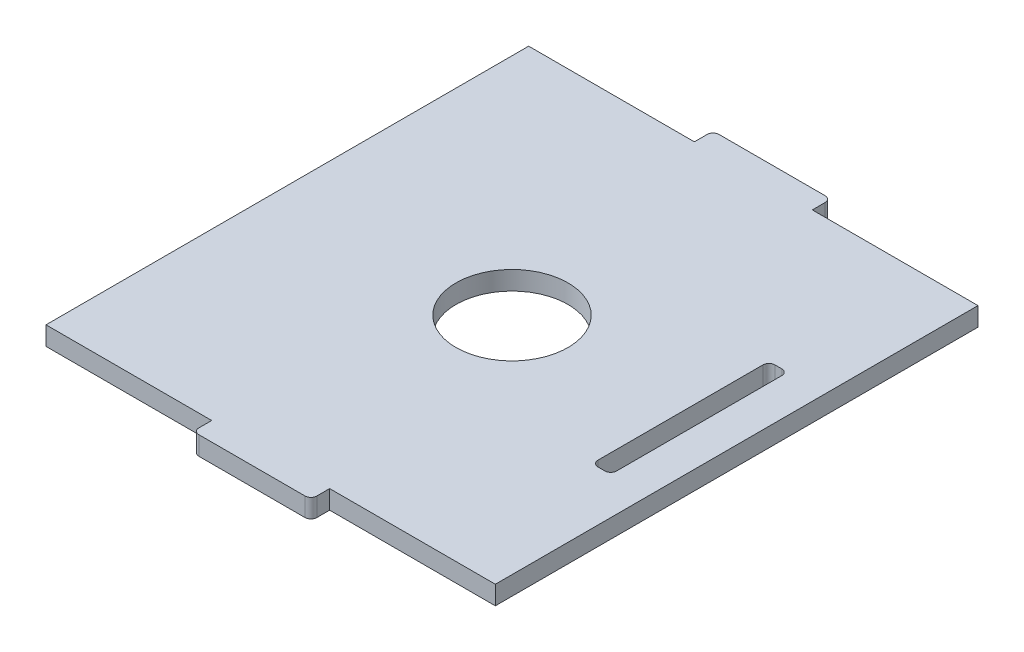
ISO-10303-21;
HEADER;
FILE_DESCRIPTION(('STEP AP214'),'2;1');
FILE_NAME('part.step','',(''),(''),'','','');
FILE_SCHEMA(('AUTOMOTIVE_DESIGN { 1 0 10303 214 1 1 1 1 }'));
ENDSEC;
DATA;
#1=APPLICATION_CONTEXT('core data for automotive mechanical design processes');
#2=APPLICATION_PROTOCOL_DEFINITION('international standard','automotive_design',2000,#1);
#3=PRODUCT_CONTEXT('',#1,'mechanical');
#4=PRODUCT('Part','Part','',(#3));
#5=PRODUCT_RELATED_PRODUCT_CATEGORY('part','',(#4));
#6=PRODUCT_DEFINITION_FORMATION('','',#4);
#7=PRODUCT_DEFINITION_CONTEXT('part definition',#1,'design');
#8=PRODUCT_DEFINITION('design','',#6,#7);
#9=PRODUCT_DEFINITION_SHAPE('','',#8);
#10=(LENGTH_UNIT() NAMED_UNIT(*) SI_UNIT(.MILLI.,.METRE.));
#11=(NAMED_UNIT(*) PLANE_ANGLE_UNIT() SI_UNIT($,.RADIAN.));
#12=(NAMED_UNIT(*) SI_UNIT($,.STERADIAN.) SOLID_ANGLE_UNIT());
#13=UNCERTAINTY_MEASURE_WITH_UNIT(LENGTH_MEASURE(1.E-05),#10,'distance_accuracy_value','');
#14=(GEOMETRIC_REPRESENTATION_CONTEXT(3) GLOBAL_UNCERTAINTY_ASSIGNED_CONTEXT((#13)) GLOBAL_UNIT_ASSIGNED_CONTEXT((#10,
#11,#12)) REPRESENTATION_CONTEXT('',''));
#15=CARTESIAN_POINT('',(0.,0.,0.));
#16=DIRECTION('',(0.,0.,1.));
#17=DIRECTION('',(1.,0.,0.));
#18=AXIS2_PLACEMENT_3D('',#15,#16,#17);
#19=CARTESIAN_POINT('',(10.,3.175,-40.925));
#20=DIRECTION('',(0.,0.,1.));
#21=DIRECTION('',(1.,0.,0.));
#22=AXIS2_PLACEMENT_3D('',#19,#20,#21);
#23=PLANE('',#22);
#24=DIRECTION('',(-1.,0.,0.));
#25=VECTOR('',#24,1.);
#26=CARTESIAN_POINT('',(10.,0.,-40.925));
#27=LINE('',#26,#25);
#28=CARTESIAN_POINT('',(38.1,0.,-40.925));
#29=VERTEX_POINT('',#28);
#30=CARTESIAN_POINT('',(10.,0.,-40.925));
#31=VERTEX_POINT('',#30);
#32=EDGE_CURVE('E235',#29,#31,#27,.T.);
#33=ORIENTED_EDGE('',*,*,#32,.T.);
#34=DIRECTION('',(0.,-1.,0.));
#35=VECTOR('',#34,1.);
#36=CARTESIAN_POINT('',(10.,3.175,-40.925));
#37=LINE('',#36,#35);
#38=CARTESIAN_POINT('',(10.,3.175,-40.925));
#39=VERTEX_POINT('',#38);
#40=EDGE_CURVE('E214',#39,#31,#37,.T.);
#41=ORIENTED_EDGE('',*,*,#40,.F.);
#42=DIRECTION('',(-1.,0.,0.));
#43=VECTOR('',#42,1.);
#44=CARTESIAN_POINT('',(10.,3.175,-40.925));
#45=LINE('',#44,#43);
#46=CARTESIAN_POINT('',(38.1,3.175,-40.925));
#47=VERTEX_POINT('',#46);
#48=EDGE_CURVE('E221',#47,#39,#45,.T.);
#49=ORIENTED_EDGE('',*,*,#48,.F.);
#50=DIRECTION('',(0.,-1.,0.));
#51=VECTOR('',#50,1.);
#52=CARTESIAN_POINT('',(38.1,3.175,-40.925));
#53=LINE('',#52,#51);
#54=EDGE_CURVE('E415',#47,#29,#53,.T.);
#55=ORIENTED_EDGE('',*,*,#54,.T.);
#56=EDGE_LOOP('',(#33,#41,#49,#55));
#57=FACE_BOUND('',#56,.T.);
#58=ADVANCED_FACE('F45',(#57),#23,.F.);
#59=CARTESIAN_POINT('',(10.,3.175,-40.925));
#60=DIRECTION('',(-1.,0.,0.));
#61=DIRECTION('',(0.,0.,1.));
#62=AXIS2_PLACEMENT_3D('',#59,#60,#61);
#63=PLANE('',#62);
#64=DIRECTION('',(0.,0.,-1.));
#65=VECTOR('',#64,1.);
#66=CARTESIAN_POINT('',(10.,0.,-40.925));
#67=LINE('',#66,#65);
#68=CARTESIAN_POINT('',(10.,0.,-43.1));
#69=VERTEX_POINT('',#68);
#70=EDGE_CURVE('E418',#31,#69,#67,.T.);
#71=ORIENTED_EDGE('',*,*,#70,.T.);
#72=DIRECTION('',(0.,-1.,0.));
#73=VECTOR('',#72,1.);
#74=CARTESIAN_POINT('',(10.,3.175,-43.1));
#75=LINE('',#74,#73);
#76=CARTESIAN_POINT('',(10.,3.175,-43.1));
#77=VERTEX_POINT('',#76);
#78=EDGE_CURVE('E217',#69,#77,#75,.F.);
#79=ORIENTED_EDGE('',*,*,#78,.T.);
#80=DIRECTION('',(0.,0.,-1.));
#81=VECTOR('',#80,1.);
#82=CARTESIAN_POINT('',(10.,3.175,-40.925));
#83=LINE('',#82,#81);
#84=EDGE_CURVE('E209',#39,#77,#83,.T.);
#85=ORIENTED_EDGE('',*,*,#84,.F.);
#86=ORIENTED_EDGE('',*,*,#40,.T.);
#87=EDGE_LOOP('',(#71,#79,#85,#86));
#88=FACE_BOUND('',#87,.T.);
#89=ADVANCED_FACE('F212',(#88),#63,.F.);
#90=CARTESIAN_POINT('',(-10.,3.175,-44.1));
#91=DIRECTION('',(0.,0.,1.));
#92=DIRECTION('',(1.,0.,0.));
#93=AXIS2_PLACEMENT_3D('',#90,#91,#92);
#94=PLANE('',#93);
#95=DIRECTION('',(-1.,0.,0.));
#96=VECTOR('',#95,1.);
#97=CARTESIAN_POINT('',(-10.,0.,-44.1));
#98=LINE('',#97,#96);
#99=CARTESIAN_POINT('',(9.,0.,-44.1));
#100=VERTEX_POINT('',#99);
#101=CARTESIAN_POINT('',(-9.,0.,-44.1));
#102=VERTEX_POINT('',#101);
#103=EDGE_CURVE('E422',#100,#102,#98,.T.);
#104=ORIENTED_EDGE('',*,*,#103,.T.);
#105=DIRECTION('',(0.,-1.,0.));
#106=VECTOR('',#105,1.);
#107=CARTESIAN_POINT('',(-9.,3.175,-44.1));
#108=LINE('',#107,#106);
#109=CARTESIAN_POINT('',(-9.,3.175,-44.1));
#110=VERTEX_POINT('',#109);
#111=EDGE_CURVE('E317',#102,#110,#108,.F.);
#112=ORIENTED_EDGE('',*,*,#111,.T.);
#113=DIRECTION('',(-1.,0.,0.));
#114=VECTOR('',#113,1.);
#115=CARTESIAN_POINT('',(-10.,3.175,-44.1));
#116=LINE('',#115,#114);
#117=CARTESIAN_POINT('',(9.,3.175,-44.1));
#118=VERTEX_POINT('',#117);
#119=EDGE_CURVE('E220',#118,#110,#116,.T.);
#120=ORIENTED_EDGE('',*,*,#119,.F.);
#121=DIRECTION('',(0.,-1.,0.));
#122=VECTOR('',#121,1.);
#123=CARTESIAN_POINT('',(9.,3.175,-44.1));
#124=LINE('',#123,#122);
#125=EDGE_CURVE('E313',#118,#100,#124,.T.);
#126=ORIENTED_EDGE('',*,*,#125,.T.);
#127=EDGE_LOOP('',(#104,#112,#120,#126));
#128=FACE_BOUND('',#127,.T.);
#129=ADVANCED_FACE('F520',(#128),#94,.F.);
#130=CARTESIAN_POINT('',(-10.,3.175,-40.925));
#131=DIRECTION('',(1.,0.,0.));
#132=DIRECTION('',(0.,0.,-1.));
#133=AXIS2_PLACEMENT_3D('',#130,#131,#132);
#134=PLANE('',#133);
#135=DIRECTION('',(0.,0.,1.));
#136=VECTOR('',#135,1.);
#137=CARTESIAN_POINT('',(-10.,3.175,-40.925));
#138=LINE('',#137,#136);
#139=CARTESIAN_POINT('',(-10.,3.175,-43.1));
#140=VERTEX_POINT('',#139);
#141=CARTESIAN_POINT('',(-10.,3.175,-40.925));
#142=VERTEX_POINT('',#141);
#143=EDGE_CURVE('E389',#140,#142,#138,.T.);
#144=ORIENTED_EDGE('',*,*,#143,.F.);
#145=DIRECTION('',(0.,-1.,0.));
#146=VECTOR('',#145,1.);
#147=CARTESIAN_POINT('',(-10.,3.175,-43.1));
#148=LINE('',#147,#146);
#149=CARTESIAN_POINT('',(-10.,0.,-43.1));
#150=VERTEX_POINT('',#149);
#151=EDGE_CURVE('E309',#140,#150,#148,.T.);
#152=ORIENTED_EDGE('',*,*,#151,.T.);
#153=DIRECTION('',(0.,0.,1.));
#154=VECTOR('',#153,1.);
#155=CARTESIAN_POINT('',(-10.,0.,-40.925));
#156=LINE('',#155,#154);
#157=CARTESIAN_POINT('',(-10.,0.,-40.925));
#158=VERTEX_POINT('',#157);
#159=EDGE_CURVE('E426',#150,#158,#156,.T.);
#160=ORIENTED_EDGE('',*,*,#159,.T.);
#161=DIRECTION('',(0.,-1.,0.));
#162=VECTOR('',#161,1.);
#163=CARTESIAN_POINT('',(-10.,3.175,-40.925));
#164=LINE('',#163,#162);
#165=EDGE_CURVE('E238',#142,#158,#164,.T.);
#166=ORIENTED_EDGE('',*,*,#165,.F.);
#167=EDGE_LOOP('',(#144,#152,#160,#166));
#168=FACE_BOUND('',#167,.T.);
#169=ADVANCED_FACE('F526',(#168),#134,.F.);
#170=CARTESIAN_POINT('',(-38.1,3.175,-40.925));
#171=DIRECTION('',(0.,0.,1.));
#172=DIRECTION('',(1.,0.,0.));
#173=AXIS2_PLACEMENT_3D('',#170,#171,#172);
#174=PLANE('',#173);
#175=DIRECTION('',(-1.,0.,0.));
#176=VECTOR('',#175,1.);
#177=CARTESIAN_POINT('',(-38.1,0.,-40.925));
#178=LINE('',#177,#176);
#179=CARTESIAN_POINT('',(-38.1,0.,-40.925));
#180=VERTEX_POINT('',#179);
#181=EDGE_CURVE('E429',#158,#180,#178,.T.);
#182=ORIENTED_EDGE('',*,*,#181,.T.);
#183=DIRECTION('',(0.,-1.,0.));
#184=VECTOR('',#183,1.);
#185=CARTESIAN_POINT('',(-38.1,3.175,-40.925));
#186=LINE('',#185,#184);
#187=CARTESIAN_POINT('',(-38.1,3.175,-40.925));
#188=VERTEX_POINT('',#187);
#189=EDGE_CURVE('E245',#188,#180,#186,.T.);
#190=ORIENTED_EDGE('',*,*,#189,.F.);
#191=DIRECTION('',(-1.,0.,0.));
#192=VECTOR('',#191,1.);
#193=CARTESIAN_POINT('',(-38.1,3.175,-40.925));
#194=LINE('',#193,#192);
#195=EDGE_CURVE('E392',#142,#188,#194,.T.);
#196=ORIENTED_EDGE('',*,*,#195,.F.);
#197=ORIENTED_EDGE('',*,*,#165,.T.);
#198=EDGE_LOOP('',(#182,#190,#196,#197));
#199=FACE_BOUND('',#198,.T.);
#200=ADVANCED_FACE('F528',(#199),#174,.F.);
#201=CARTESIAN_POINT('',(-38.1,3.175,40.925));
#202=DIRECTION('',(1.,0.,0.));
#203=DIRECTION('',(0.,0.,-1.));
#204=AXIS2_PLACEMENT_3D('',#201,#202,#203);
#205=PLANE('',#204);
#206=DIRECTION('',(0.,0.,1.));
#207=VECTOR('',#206,1.);
#208=CARTESIAN_POINT('',(-38.1,0.,40.925));
#209=LINE('',#208,#207);
#210=CARTESIAN_POINT('',(-38.1,0.,40.925));
#211=VERTEX_POINT('',#210);
#212=EDGE_CURVE('E432',#180,#211,#209,.T.);
#213=ORIENTED_EDGE('',*,*,#212,.T.);
#214=DIRECTION('',(0.,-1.,0.));
#215=VECTOR('',#214,1.);
#216=CARTESIAN_POINT('',(-38.1,3.175,40.925));
#217=LINE('',#216,#215);
#218=CARTESIAN_POINT('',(-38.1,3.175,40.925));
#219=VERTEX_POINT('',#218);
#220=EDGE_CURVE('E467',#219,#211,#217,.T.);
#221=ORIENTED_EDGE('',*,*,#220,.F.);
#222=DIRECTION('',(0.,0.,1.));
#223=VECTOR('',#222,1.);
#224=CARTESIAN_POINT('',(-38.1,3.175,40.925));
#225=LINE('',#224,#223);
#226=EDGE_CURVE('E395',#188,#219,#225,.T.);
#227=ORIENTED_EDGE('',*,*,#226,.F.);
#228=ORIENTED_EDGE('',*,*,#189,.T.);
#229=EDGE_LOOP('',(#213,#221,#227,#228));
#230=FACE_BOUND('',#229,.T.);
#231=ADVANCED_FACE('F476',(#230),#205,.F.);
#232=CARTESIAN_POINT('',(-38.1,3.175,40.925));
#233=DIRECTION('',(0.,0.,-1.));
#234=DIRECTION('',(-1.,0.,0.));
#235=AXIS2_PLACEMENT_3D('',#232,#233,#234);
#236=PLANE('',#235);
#237=DIRECTION('',(1.,0.,0.));
#238=VECTOR('',#237,1.);
#239=CARTESIAN_POINT('',(-38.1,0.,40.925));
#240=LINE('',#239,#238);
#241=CARTESIAN_POINT('',(-10.,0.,40.925));
#242=VERTEX_POINT('',#241);
#243=EDGE_CURVE('E435',#211,#242,#240,.T.);
#244=ORIENTED_EDGE('',*,*,#243,.T.);
#245=DIRECTION('',(0.,-1.,0.));
#246=VECTOR('',#245,1.);
#247=CARTESIAN_POINT('',(-10.,3.175,40.925));
#248=LINE('',#247,#246);
#249=CARTESIAN_POINT('',(-10.,3.175,40.925));
#250=VERTEX_POINT('',#249);
#251=EDGE_CURVE('E463',#250,#242,#248,.T.);
#252=ORIENTED_EDGE('',*,*,#251,.F.);
#253=DIRECTION('',(1.,0.,0.));
#254=VECTOR('',#253,1.);
#255=CARTESIAN_POINT('',(-38.1,3.175,40.925));
#256=LINE('',#255,#254);
#257=EDGE_CURVE('E398',#219,#250,#256,.T.);
#258=ORIENTED_EDGE('',*,*,#257,.F.);
#259=ORIENTED_EDGE('',*,*,#220,.T.);
#260=EDGE_LOOP('',(#244,#252,#258,#259));
#261=FACE_BOUND('',#260,.T.);
#262=ADVANCED_FACE('F487',(#261),#236,.F.);
#263=CARTESIAN_POINT('',(-10.,3.175,40.925));
#264=DIRECTION('',(1.,0.,0.));
#265=DIRECTION('',(0.,0.,-1.));
#266=AXIS2_PLACEMENT_3D('',#263,#264,#265);
#267=PLANE('',#266);
#268=DIRECTION('',(0.,0.,1.));
#269=VECTOR('',#268,1.);
#270=CARTESIAN_POINT('',(-10.,0.,40.925));
#271=LINE('',#270,#269);
#272=CARTESIAN_POINT('',(-10.,0.,43.1));
#273=VERTEX_POINT('',#272);
#274=EDGE_CURVE('E438',#242,#273,#271,.T.);
#275=ORIENTED_EDGE('',*,*,#274,.T.);
#276=DIRECTION('',(0.,-1.,0.));
#277=VECTOR('',#276,1.);
#278=CARTESIAN_POINT('',(-10.,3.175,43.1));
#279=LINE('',#278,#277);
#280=CARTESIAN_POINT('',(-10.,3.175,43.1));
#281=VERTEX_POINT('',#280);
#282=EDGE_CURVE('E61',#273,#281,#279,.F.);
#283=ORIENTED_EDGE('',*,*,#282,.T.);
#284=DIRECTION('',(0.,0.,1.));
#285=VECTOR('',#284,1.);
#286=CARTESIAN_POINT('',(-10.,3.175,40.925));
#287=LINE('',#286,#285);
#288=EDGE_CURVE('E401',#250,#281,#287,.T.);
#289=ORIENTED_EDGE('',*,*,#288,.F.);
#290=ORIENTED_EDGE('',*,*,#251,.T.);
#291=EDGE_LOOP('',(#275,#283,#289,#290));
#292=FACE_BOUND('',#291,.T.);
#293=ADVANCED_FACE('F489',(#292),#267,.F.);
#294=CARTESIAN_POINT('',(-10.,3.175,44.1));
#295=DIRECTION('',(0.,0.,-1.));
#296=DIRECTION('',(-1.,0.,0.));
#297=AXIS2_PLACEMENT_3D('',#294,#295,#296);
#298=PLANE('',#297);
#299=DIRECTION('',(1.,0.,0.));
#300=VECTOR('',#299,1.);
#301=CARTESIAN_POINT('',(-10.,0.,44.1));
#302=LINE('',#301,#300);
#303=CARTESIAN_POINT('',(-9.,0.,44.1));
#304=VERTEX_POINT('',#303);
#305=CARTESIAN_POINT('',(9.,0.,44.1));
#306=VERTEX_POINT('',#305);
#307=EDGE_CURVE('E441',#304,#306,#302,.T.);
#308=ORIENTED_EDGE('',*,*,#307,.T.);
#309=DIRECTION('',(0.,-1.,0.));
#310=VECTOR('',#309,1.);
#311=CARTESIAN_POINT('',(9.,3.175,44.1));
#312=LINE('',#311,#310);
#313=CARTESIAN_POINT('',(9.,3.175,44.1));
#314=VERTEX_POINT('',#313);
#315=EDGE_CURVE('E293',#306,#314,#312,.F.);
#316=ORIENTED_EDGE('',*,*,#315,.T.);
#317=DIRECTION('',(1.,0.,0.));
#318=VECTOR('',#317,1.);
#319=CARTESIAN_POINT('',(-10.,3.175,44.1));
#320=LINE('',#319,#318);
#321=CARTESIAN_POINT('',(-9.,3.175,44.1));
#322=VERTEX_POINT('',#321);
#323=EDGE_CURVE('E404',#322,#314,#320,.T.);
#324=ORIENTED_EDGE('',*,*,#323,.F.);
#325=DIRECTION('',(0.,-1.,0.));
#326=VECTOR('',#325,1.);
#327=CARTESIAN_POINT('',(-9.,3.175,44.1));
#328=LINE('',#327,#326);
#329=EDGE_CURVE('E289',#322,#304,#328,.T.);
#330=ORIENTED_EDGE('',*,*,#329,.T.);
#331=EDGE_LOOP('',(#308,#316,#324,#330));
#332=FACE_BOUND('',#331,.T.);
#333=ADVANCED_FACE('F497',(#332),#298,.F.);
#334=CARTESIAN_POINT('',(10.,3.175,40.925));
#335=DIRECTION('',(-1.,0.,0.));
#336=DIRECTION('',(0.,0.,1.));
#337=AXIS2_PLACEMENT_3D('',#334,#335,#336);
#338=PLANE('',#337);
#339=DIRECTION('',(0.,0.,-1.));
#340=VECTOR('',#339,1.);
#341=CARTESIAN_POINT('',(10.,3.175,40.925));
#342=LINE('',#341,#340);
#343=CARTESIAN_POINT('',(10.,3.175,43.1));
#344=VERTEX_POINT('',#343);
#345=CARTESIAN_POINT('',(10.,3.175,40.925));
#346=VERTEX_POINT('',#345);
#347=EDGE_CURVE('E407',#344,#346,#342,.T.);
#348=ORIENTED_EDGE('',*,*,#347,.F.);
#349=DIRECTION('',(0.,-1.,0.));
#350=VECTOR('',#349,1.);
#351=CARTESIAN_POINT('',(10.,3.175,43.1));
#352=LINE('',#351,#350);
#353=CARTESIAN_POINT('',(10.,0.,43.1));
#354=VERTEX_POINT('',#353);
#355=EDGE_CURVE('E273',#344,#354,#352,.T.);
#356=ORIENTED_EDGE('',*,*,#355,.T.);
#357=DIRECTION('',(0.,0.,-1.));
#358=VECTOR('',#357,1.);
#359=CARTESIAN_POINT('',(10.,0.,40.925));
#360=LINE('',#359,#358);
#361=CARTESIAN_POINT('',(10.,0.,40.925));
#362=VERTEX_POINT('',#361);
#363=EDGE_CURVE('E445',#354,#362,#360,.T.);
#364=ORIENTED_EDGE('',*,*,#363,.T.);
#365=DIRECTION('',(0.,-1.,0.));
#366=VECTOR('',#365,1.);
#367=CARTESIAN_POINT('',(10.,3.175,40.925));
#368=LINE('',#367,#366);
#369=EDGE_CURVE('E459',#346,#362,#368,.T.);
#370=ORIENTED_EDGE('',*,*,#369,.F.);
#371=EDGE_LOOP('',(#348,#356,#364,#370));
#372=FACE_BOUND('',#371,.T.);
#373=ADVANCED_FACE('F506',(#372),#338,.F.);
#374=CARTESIAN_POINT('',(10.,3.175,40.925));
#375=DIRECTION('',(0.,0.,-1.));
#376=DIRECTION('',(-1.,0.,0.));
#377=AXIS2_PLACEMENT_3D('',#374,#375,#376);
#378=PLANE('',#377);
#379=DIRECTION('',(1.,0.,0.));
#380=VECTOR('',#379,1.);
#381=CARTESIAN_POINT('',(10.,0.,40.925));
#382=LINE('',#381,#380);
#383=CARTESIAN_POINT('',(38.1,0.,40.925));
#384=VERTEX_POINT('',#383);
#385=EDGE_CURVE('E448',#362,#384,#382,.T.);
#386=ORIENTED_EDGE('',*,*,#385,.T.);
#387=DIRECTION('',(0.,-1.,0.));
#388=VECTOR('',#387,1.);
#389=CARTESIAN_POINT('',(38.1,3.175,40.925));
#390=LINE('',#389,#388);
#391=CARTESIAN_POINT('',(38.1,3.175,40.925));
#392=VERTEX_POINT('',#391);
#393=EDGE_CURVE('E455',#392,#384,#390,.T.);
#394=ORIENTED_EDGE('',*,*,#393,.F.);
#395=DIRECTION('',(1.,0.,0.));
#396=VECTOR('',#395,1.);
#397=CARTESIAN_POINT('',(10.,3.175,40.925));
#398=LINE('',#397,#396);
#399=EDGE_CURVE('E410',#346,#392,#398,.T.);
#400=ORIENTED_EDGE('',*,*,#399,.F.);
#401=ORIENTED_EDGE('',*,*,#369,.T.);
#402=EDGE_LOOP('',(#386,#394,#400,#401));
#403=FACE_BOUND('',#402,.T.);
#404=ADVANCED_FACE('F511',(#403),#378,.F.);
#405=CARTESIAN_POINT('',(38.1,3.175,40.925));
#406=DIRECTION('',(-1.,0.,0.));
#407=DIRECTION('',(0.,0.,1.));
#408=AXIS2_PLACEMENT_3D('',#405,#406,#407);
#409=PLANE('',#408);
#410=DIRECTION('',(0.,0.,-1.));
#411=VECTOR('',#410,1.);
#412=CARTESIAN_POINT('',(38.1,0.,40.925));
#413=LINE('',#412,#411);
#414=EDGE_CURVE('E232',#384,#29,#413,.T.);
#415=ORIENTED_EDGE('',*,*,#414,.T.);
#416=ORIENTED_EDGE('',*,*,#54,.F.);
#417=DIRECTION('',(0.,0.,-1.));
#418=VECTOR('',#417,1.);
#419=CARTESIAN_POINT('',(38.1,3.175,40.925));
#420=LINE('',#419,#418);
#421=EDGE_CURVE('E227',#392,#47,#420,.T.);
#422=ORIENTED_EDGE('',*,*,#421,.F.);
#423=ORIENTED_EDGE('',*,*,#393,.T.);
#424=EDGE_LOOP('',(#415,#416,#422,#423));
#425=FACE_BOUND('',#424,.T.);
#426=ADVANCED_FACE('F514',(#425),#409,.F.);
#427=CARTESIAN_POINT('',(0.,3.175,0.));
#428=DIRECTION('',(0.,1.,0.));
#429=DIRECTION('',(0.,0.,1.));
#430=AXIS2_PLACEMENT_3D('',#427,#428,#429);
#431=PLANE('',#430);
#432=CARTESIAN_POINT('',(0.,3.175,0.));
#433=DIRECTION('',(0.,1.,0.));
#434=DIRECTION('',(0.,0.,1.));
#435=AXIS2_PLACEMENT_3D('',#432,#433,#434);
#436=CIRCLE('',#435,9.5);
#437=CARTESIAN_POINT('',(0.,3.175,9.5));
#438=VERTEX_POINT('',#437);
#439=EDGE_CURVE('E759',#438,#438,#436,.T.);
#440=ORIENTED_EDGE('',*,*,#439,.F.);
#441=EDGE_LOOP('',(#440));
#442=FACE_BOUND('',#441,.T.);
#443=DIRECTION('',(0.,0.,1.));
#444=VECTOR('',#443,1.);
#445=CARTESIAN_POINT('',(28.575,3.175,-15.));
#446=LINE('',#445,#444);
#447=CARTESIAN_POINT('',(28.575,3.175,-14.));
#448=VERTEX_POINT('',#447);
#449=CARTESIAN_POINT('',(28.575,3.175,14.));
#450=VERTEX_POINT('',#449);
#451=EDGE_CURVE('E357',#448,#450,#446,.T.);
#452=ORIENTED_EDGE('',*,*,#451,.F.);
#453=CARTESIAN_POINT('',(29.575,3.175,-14.));
#454=DIRECTION('',(0.,1.,0.));
#455=DIRECTION('',(0.,0.,1.));
#456=AXIS2_PLACEMENT_3D('',#453,#454,#455);
#457=CIRCLE('',#456,1.);
#458=CARTESIAN_POINT('',(29.575,3.175,-15.));
#459=VERTEX_POINT('',#458);
#460=EDGE_CURVE('E322',#448,#459,#457,.F.);
#461=ORIENTED_EDGE('',*,*,#460,.T.);
#462=DIRECTION('',(-1.,0.,0.));
#463=VECTOR('',#462,1.);
#464=CARTESIAN_POINT('',(31.75,3.175,-15.));
#465=LINE('',#464,#463);
#466=CARTESIAN_POINT('',(30.75,3.175,-15.));
#467=VERTEX_POINT('',#466);
#468=EDGE_CURVE('E385',#467,#459,#465,.T.);
#469=ORIENTED_EDGE('',*,*,#468,.F.);
#470=CARTESIAN_POINT('',(30.75,3.175,-14.));
#471=DIRECTION('',(0.,1.,0.));
#472=DIRECTION('',(0.,0.,1.));
#473=AXIS2_PLACEMENT_3D('',#470,#471,#472);
#474=CIRCLE('',#473,1.);
#475=CARTESIAN_POINT('',(31.75,3.175,-14.));
#476=VERTEX_POINT('',#475);
#477=EDGE_CURVE('E328',#467,#476,#474,.F.);
#478=ORIENTED_EDGE('',*,*,#477,.T.);
#479=DIRECTION('',(0.,0.,-1.));
#480=VECTOR('',#479,1.);
#481=CARTESIAN_POINT('',(31.75,3.175,-15.));
#482=LINE('',#481,#480);
#483=CARTESIAN_POINT('',(31.75,3.175,14.));
#484=VERTEX_POINT('',#483);
#485=EDGE_CURVE('E347',#484,#476,#482,.T.);
#486=ORIENTED_EDGE('',*,*,#485,.F.);
#487=CARTESIAN_POINT('',(30.75,3.175,14.));
#488=DIRECTION('',(0.,1.,0.));
#489=DIRECTION('',(0.,0.,1.));
#490=AXIS2_PLACEMENT_3D('',#487,#488,#489);
#491=CIRCLE('',#490,1.);
#492=CARTESIAN_POINT('',(30.75,3.175,15.));
#493=VERTEX_POINT('',#492);
#494=EDGE_CURVE('E54',#484,#493,#491,.F.);
#495=ORIENTED_EDGE('',*,*,#494,.T.);
#496=DIRECTION('',(1.,0.,0.));
#497=VECTOR('',#496,1.);
#498=CARTESIAN_POINT('',(31.75,3.175,15.));
#499=LINE('',#498,#497);
#500=CARTESIAN_POINT('',(29.575,3.175,15.));
#501=VERTEX_POINT('',#500);
#502=EDGE_CURVE('E345',#501,#493,#499,.T.);
#503=ORIENTED_EDGE('',*,*,#502,.F.);
#504=CARTESIAN_POINT('',(29.575,3.175,14.));
#505=DIRECTION('',(0.,1.,0.));
#506=DIRECTION('',(0.,0.,1.));
#507=AXIS2_PLACEMENT_3D('',#504,#505,#506);
#508=CIRCLE('',#507,1.);
#509=EDGE_CURVE('E334',#501,#450,#508,.F.);
#510=ORIENTED_EDGE('',*,*,#509,.T.);
#511=EDGE_LOOP('',(#452,#461,#469,#478,#486,#495,#503,#510));
#512=FACE_BOUND('',#511,.T.);
#513=ORIENTED_EDGE('',*,*,#323,.T.);
#514=CARTESIAN_POINT('',(9.,3.175,43.1));
#515=DIRECTION('',(0.,1.,0.));
#516=DIRECTION('',(0.,0.,1.));
#517=AXIS2_PLACEMENT_3D('',#514,#515,#516);
#518=CIRCLE('',#517,1.);
#519=EDGE_CURVE('E304',#314,#344,#518,.T.);
#520=ORIENTED_EDGE('',*,*,#519,.T.);
#521=ORIENTED_EDGE('',*,*,#347,.T.);
#522=ORIENTED_EDGE('',*,*,#399,.T.);
#523=ORIENTED_EDGE('',*,*,#421,.T.);
#524=ORIENTED_EDGE('',*,*,#48,.T.);
#525=ORIENTED_EDGE('',*,*,#84,.T.);
#526=CARTESIAN_POINT('',(9.,3.175,-43.1));
#527=DIRECTION('',(0.,1.,0.));
#528=DIRECTION('',(0.,0.,1.));
#529=AXIS2_PLACEMENT_3D('',#526,#527,#528);
#530=CIRCLE('',#529,1.);
#531=EDGE_CURVE('E296',#77,#118,#530,.T.);
#532=ORIENTED_EDGE('',*,*,#531,.T.);
#533=ORIENTED_EDGE('',*,*,#119,.T.);
#534=CARTESIAN_POINT('',(-9.,3.175,-43.1));
#535=DIRECTION('',(0.,1.,0.));
#536=DIRECTION('',(0.,0.,1.));
#537=AXIS2_PLACEMENT_3D('',#534,#535,#536);
#538=CIRCLE('',#537,1.);
#539=EDGE_CURVE('E69',#110,#140,#538,.T.);
#540=ORIENTED_EDGE('',*,*,#539,.T.);
#541=ORIENTED_EDGE('',*,*,#143,.T.);
#542=ORIENTED_EDGE('',*,*,#195,.T.);
#543=ORIENTED_EDGE('',*,*,#226,.T.);
#544=ORIENTED_EDGE('',*,*,#257,.T.);
#545=ORIENTED_EDGE('',*,*,#288,.T.);
#546=CARTESIAN_POINT('',(-9.,3.175,43.1));
#547=DIRECTION('',(0.,1.,0.));
#548=DIRECTION('',(0.,0.,1.));
#549=AXIS2_PLACEMENT_3D('',#546,#547,#548);
#550=CIRCLE('',#549,1.);
#551=EDGE_CURVE('E301',#281,#322,#550,.T.);
#552=ORIENTED_EDGE('',*,*,#551,.T.);
#553=EDGE_LOOP('',(#513,#520,#521,#522,#523,#524,#525,#532,#533,#540,#541,#542,#543,#544,#545,#552));
#554=FACE_BOUND('',#553,.T.);
#555=ADVANCED_FACE('F225',(#442,#512,#554),#431,.T.);
#556=CARTESIAN_POINT('',(0.,0.,0.));
#557=DIRECTION('',(0.,1.,0.));
#558=DIRECTION('',(0.,0.,1.));
#559=AXIS2_PLACEMENT_3D('',#556,#557,#558);
#560=PLANE('',#559);
#561=CARTESIAN_POINT('',(0.,0.,0.));
#562=DIRECTION('',(0.,1.,0.));
#563=DIRECTION('',(0.,0.,1.));
#564=AXIS2_PLACEMENT_3D('',#561,#562,#563);
#565=CIRCLE('',#564,9.5);
#566=CARTESIAN_POINT('',(0.,0.,9.5));
#567=VERTEX_POINT('',#566);
#568=EDGE_CURVE('E419',#567,#567,#565,.T.);
#569=ORIENTED_EDGE('',*,*,#568,.T.);
#570=EDGE_LOOP('',(#569));
#571=FACE_BOUND('',#570,.T.);
#572=DIRECTION('',(0.,0.,-1.));
#573=VECTOR('',#572,1.);
#574=CARTESIAN_POINT('',(31.75,0.,-15.));
#575=LINE('',#574,#573);
#576=CARTESIAN_POINT('',(31.75,0.,14.));
#577=VERTEX_POINT('',#576);
#578=CARTESIAN_POINT('',(31.75,0.,-14.));
#579=VERTEX_POINT('',#578);
#580=EDGE_CURVE('E366',#577,#579,#575,.T.);
#581=ORIENTED_EDGE('',*,*,#580,.T.);
#582=CARTESIAN_POINT('',(30.75,0.,-14.));
#583=DIRECTION('',(0.,1.,0.));
#584=DIRECTION('',(0.,0.,1.));
#585=AXIS2_PLACEMENT_3D('',#582,#583,#584);
#586=CIRCLE('',#585,1.);
#587=CARTESIAN_POINT('',(30.75,0.,-15.));
#588=VERTEX_POINT('',#587);
#589=EDGE_CURVE('E331',#579,#588,#586,.T.);
#590=ORIENTED_EDGE('',*,*,#589,.T.);
#591=DIRECTION('',(-1.,0.,0.));
#592=VECTOR('',#591,1.);
#593=CARTESIAN_POINT('',(31.75,0.,-15.));
#594=LINE('',#593,#592);
#595=CARTESIAN_POINT('',(29.575,0.,-15.));
#596=VERTEX_POINT('',#595);
#597=EDGE_CURVE('E373',#588,#596,#594,.T.);
#598=ORIENTED_EDGE('',*,*,#597,.T.);
#599=CARTESIAN_POINT('',(29.575,0.,-14.));
#600=DIRECTION('',(0.,1.,0.));
#601=DIRECTION('',(0.,0.,1.));
#602=AXIS2_PLACEMENT_3D('',#599,#600,#601);
#603=CIRCLE('',#602,1.);
#604=CARTESIAN_POINT('',(28.575,0.,-14.));
#605=VERTEX_POINT('',#604);
#606=EDGE_CURVE('E325',#596,#605,#603,.T.);
#607=ORIENTED_EDGE('',*,*,#606,.T.);
#608=DIRECTION('',(0.,0.,1.));
#609=VECTOR('',#608,1.);
#610=CARTESIAN_POINT('',(28.575,0.,-15.));
#611=LINE('',#610,#609);
#612=CARTESIAN_POINT('',(28.575,0.,14.));
#613=VERTEX_POINT('',#612);
#614=EDGE_CURVE('E377',#605,#613,#611,.T.);
#615=ORIENTED_EDGE('',*,*,#614,.T.);
#616=CARTESIAN_POINT('',(29.575,0.,14.));
#617=DIRECTION('',(0.,1.,0.));
#618=DIRECTION('',(0.,0.,1.));
#619=AXIS2_PLACEMENT_3D('',#616,#617,#618);
#620=CIRCLE('',#619,1.);
#621=CARTESIAN_POINT('',(29.575,0.,15.));
#622=VERTEX_POINT('',#621);
#623=EDGE_CURVE('E337',#613,#622,#620,.T.);
#624=ORIENTED_EDGE('',*,*,#623,.T.);
#625=DIRECTION('',(1.,0.,0.));
#626=VECTOR('',#625,1.);
#627=CARTESIAN_POINT('',(31.75,0.,15.));
#628=LINE('',#627,#626);
#629=CARTESIAN_POINT('',(30.75,0.,15.));
#630=VERTEX_POINT('',#629);
#631=EDGE_CURVE('E368',#622,#630,#628,.T.);
#632=ORIENTED_EDGE('',*,*,#631,.T.);
#633=CARTESIAN_POINT('',(30.75,0.,14.));
#634=DIRECTION('',(0.,1.,0.));
#635=DIRECTION('',(0.,0.,1.));
#636=AXIS2_PLACEMENT_3D('',#633,#634,#635);
#637=CIRCLE('',#636,1.);
#638=EDGE_CURVE('E11',#630,#577,#637,.T.);
#639=ORIENTED_EDGE('',*,*,#638,.T.);
#640=EDGE_LOOP('',(#581,#590,#598,#607,#615,#624,#632,#639));
#641=FACE_BOUND('',#640,.T.);
#642=ORIENTED_EDGE('',*,*,#363,.F.);
#643=CARTESIAN_POINT('',(9.,0.,43.1));
#644=DIRECTION('',(0.,1.,0.));
#645=DIRECTION('',(0.,0.,1.));
#646=AXIS2_PLACEMENT_3D('',#643,#644,#645);
#647=CIRCLE('',#646,1.);
#648=EDGE_CURVE('E286',#354,#306,#647,.F.);
#649=ORIENTED_EDGE('',*,*,#648,.T.);
#650=ORIENTED_EDGE('',*,*,#307,.F.);
#651=CARTESIAN_POINT('',(-9.,0.,43.1));
#652=DIRECTION('',(0.,1.,0.));
#653=DIRECTION('',(0.,0.,1.));
#654=AXIS2_PLACEMENT_3D('',#651,#652,#653);
#655=CIRCLE('',#654,1.);
#656=EDGE_CURVE('E283',#304,#273,#655,.F.);
#657=ORIENTED_EDGE('',*,*,#656,.T.);
#658=ORIENTED_EDGE('',*,*,#274,.F.);
#659=ORIENTED_EDGE('',*,*,#243,.F.);
#660=ORIENTED_EDGE('',*,*,#212,.F.);
#661=ORIENTED_EDGE('',*,*,#181,.F.);
#662=ORIENTED_EDGE('',*,*,#159,.F.);
#663=CARTESIAN_POINT('',(-9.,0.,-43.1));
#664=DIRECTION('',(0.,1.,0.));
#665=DIRECTION('',(0.,0.,1.));
#666=AXIS2_PLACEMENT_3D('',#663,#664,#665);
#667=CIRCLE('',#666,1.);
#668=EDGE_CURVE('E280',#150,#102,#667,.F.);
#669=ORIENTED_EDGE('',*,*,#668,.T.);
#670=ORIENTED_EDGE('',*,*,#103,.F.);
#671=CARTESIAN_POINT('',(9.,0.,-43.1));
#672=DIRECTION('',(0.,1.,0.));
#673=DIRECTION('',(0.,0.,1.));
#674=AXIS2_PLACEMENT_3D('',#671,#672,#673);
#675=CIRCLE('',#674,1.);
#676=EDGE_CURVE('E277',#100,#69,#675,.F.);
#677=ORIENTED_EDGE('',*,*,#676,.T.);
#678=ORIENTED_EDGE('',*,*,#70,.F.);
#679=ORIENTED_EDGE('',*,*,#32,.F.);
#680=ORIENTED_EDGE('',*,*,#414,.F.);
#681=ORIENTED_EDGE('',*,*,#385,.F.);
#682=EDGE_LOOP('',(#642,#649,#650,#657,#658,#659,#660,#661,#662,#669,#670,#677,#678,#679,#680,#681));
#683=FACE_BOUND('',#682,.T.);
#684=ADVANCED_FACE('F364',(#571,#641,#683),#560,.F.);
#685=CARTESIAN_POINT('',(28.575,0.,-15.));
#686=DIRECTION('',(-1.,0.,0.));
#687=DIRECTION('',(0.,0.,1.));
#688=AXIS2_PLACEMENT_3D('',#685,#686,#687);
#689=PLANE('',#688);
#690=ORIENTED_EDGE('',*,*,#614,.F.);
#691=DIRECTION('',(0.,1.,0.));
#692=VECTOR('',#691,1.);
#693=CARTESIAN_POINT('',(28.575,3.175,-14.));
#694=LINE('',#693,#692);
#695=EDGE_CURVE('E242',#605,#448,#694,.T.);
#696=ORIENTED_EDGE('',*,*,#695,.T.);
#697=ORIENTED_EDGE('',*,*,#451,.T.);
#698=DIRECTION('',(0.,1.,0.));
#699=VECTOR('',#698,1.);
#700=CARTESIAN_POINT('',(28.575,0.,14.));
#701=LINE('',#700,#699);
#702=EDGE_CURVE('E237',#450,#613,#701,.F.);
#703=ORIENTED_EDGE('',*,*,#702,.T.);
#704=EDGE_LOOP('',(#690,#696,#697,#703));
#705=FACE_BOUND('',#704,.T.);
#706=ADVANCED_FACE('F646',(#705),#689,.F.);
#707=CARTESIAN_POINT('',(31.75,0.,-15.));
#708=DIRECTION('',(0.,0.,-1.));
#709=DIRECTION('',(-1.,0.,0.));
#710=AXIS2_PLACEMENT_3D('',#707,#708,#709);
#711=PLANE('',#710);
#712=ORIENTED_EDGE('',*,*,#468,.T.);
#713=DIRECTION('',(0.,1.,0.));
#714=VECTOR('',#713,1.);
#715=CARTESIAN_POINT('',(29.575,0.,-15.));
#716=LINE('',#715,#714);
#717=EDGE_CURVE('E256',#459,#596,#716,.F.);
#718=ORIENTED_EDGE('',*,*,#717,.T.);
#719=ORIENTED_EDGE('',*,*,#597,.F.);
#720=DIRECTION('',(0.,1.,0.));
#721=VECTOR('',#720,1.);
#722=CARTESIAN_POINT('',(30.75,3.175,-15.));
#723=LINE('',#722,#721);
#724=EDGE_CURVE('E252',#588,#467,#723,.T.);
#725=ORIENTED_EDGE('',*,*,#724,.T.);
#726=EDGE_LOOP('',(#712,#718,#719,#725));
#727=FACE_BOUND('',#726,.T.);
#728=ADVANCED_FACE('F637',(#727),#711,.F.);
#729=CARTESIAN_POINT('',(31.75,0.,-15.));
#730=DIRECTION('',(1.,0.,0.));
#731=DIRECTION('',(0.,0.,-1.));
#732=AXIS2_PLACEMENT_3D('',#729,#730,#731);
#733=PLANE('',#732);
#734=ORIENTED_EDGE('',*,*,#485,.T.);
#735=DIRECTION('',(0.,1.,0.));
#736=VECTOR('',#735,1.);
#737=CARTESIAN_POINT('',(31.75,0.,-14.));
#738=LINE('',#737,#736);
#739=EDGE_CURVE('E263',#476,#579,#738,.F.);
#740=ORIENTED_EDGE('',*,*,#739,.T.);
#741=ORIENTED_EDGE('',*,*,#580,.F.);
#742=DIRECTION('',(0.,1.,0.));
#743=VECTOR('',#742,1.);
#744=CARTESIAN_POINT('',(31.75,3.175,14.));
#745=LINE('',#744,#743);
#746=EDGE_CURVE('E259',#577,#484,#745,.T.);
#747=ORIENTED_EDGE('',*,*,#746,.T.);
#748=EDGE_LOOP('',(#734,#740,#741,#747));
#749=FACE_BOUND('',#748,.T.);
#750=ADVANCED_FACE('F370',(#749),#733,.F.);
#751=CARTESIAN_POINT('',(31.75,0.,15.));
#752=DIRECTION('',(0.,0.,1.));
#753=DIRECTION('',(1.,0.,0.));
#754=AXIS2_PLACEMENT_3D('',#751,#752,#753);
#755=PLANE('',#754);
#756=ORIENTED_EDGE('',*,*,#631,.F.);
#757=DIRECTION('',(0.,1.,0.));
#758=VECTOR('',#757,1.);
#759=CARTESIAN_POINT('',(29.575,3.175,15.));
#760=LINE('',#759,#758);
#761=EDGE_CURVE('E269',#622,#501,#760,.T.);
#762=ORIENTED_EDGE('',*,*,#761,.T.);
#763=ORIENTED_EDGE('',*,*,#502,.T.);
#764=DIRECTION('',(0.,1.,0.));
#765=VECTOR('',#764,1.);
#766=CARTESIAN_POINT('',(30.75,0.,15.));
#767=LINE('',#766,#765);
#768=EDGE_CURVE('E266',#493,#630,#767,.F.);
#769=ORIENTED_EDGE('',*,*,#768,.T.);
#770=EDGE_LOOP('',(#756,#762,#763,#769));
#771=FACE_BOUND('',#770,.T.);
#772=ADVANCED_FACE('F353',(#771),#755,.F.);
#773=CARTESIAN_POINT('',(0.,0.,0.));
#774=DIRECTION('',(0.,1.,0.));
#775=DIRECTION('',(0.,0.,1.));
#776=AXIS2_PLACEMENT_3D('',#773,#774,#775);
#777=CYLINDRICAL_SURFACE('',#776,9.5);
#778=ORIENTED_EDGE('',*,*,#568,.F.);
#779=EDGE_LOOP('',(#778));
#780=FACE_BOUND('',#779,.T.);
#781=ORIENTED_EDGE('',*,*,#439,.T.);
#782=EDGE_LOOP('',(#781));
#783=FACE_BOUND('',#782,.T.);
#784=ADVANCED_FACE('F549',(#780,#783),#777,.F.);
#785=CARTESIAN_POINT('',(29.575,0.,-14.));
#786=DIRECTION('',(0.,-1.,0.));
#787=DIRECTION('',(0.,0.,-1.));
#788=AXIS2_PLACEMENT_3D('',#785,#786,#787);
#789=CYLINDRICAL_SURFACE('',#788,1.);
#790=ORIENTED_EDGE('',*,*,#606,.F.);
#791=ORIENTED_EDGE('',*,*,#717,.F.);
#792=ORIENTED_EDGE('',*,*,#460,.F.);
#793=ORIENTED_EDGE('',*,*,#695,.F.);
#794=EDGE_LOOP('',(#790,#791,#792,#793));
#795=FACE_BOUND('',#794,.T.);
#796=ADVANCED_FACE('F545',(#795),#789,.F.);
#797=CARTESIAN_POINT('',(30.75,0.,-14.));
#798=DIRECTION('',(0.,-1.,0.));
#799=DIRECTION('',(0.,0.,-1.));
#800=AXIS2_PLACEMENT_3D('',#797,#798,#799);
#801=CYLINDRICAL_SURFACE('',#800,1.);
#802=ORIENTED_EDGE('',*,*,#589,.F.);
#803=ORIENTED_EDGE('',*,*,#739,.F.);
#804=ORIENTED_EDGE('',*,*,#477,.F.);
#805=ORIENTED_EDGE('',*,*,#724,.F.);
#806=EDGE_LOOP('',(#802,#803,#804,#805));
#807=FACE_BOUND('',#806,.T.);
#808=ADVANCED_FACE('F548',(#807),#801,.F.);
#809=CARTESIAN_POINT('',(29.575,0.,14.));
#810=DIRECTION('',(0.,-1.,0.));
#811=DIRECTION('',(0.,0.,-1.));
#812=AXIS2_PLACEMENT_3D('',#809,#810,#811);
#813=CYLINDRICAL_SURFACE('',#812,1.);
#814=ORIENTED_EDGE('',*,*,#623,.F.);
#815=ORIENTED_EDGE('',*,*,#702,.F.);
#816=ORIENTED_EDGE('',*,*,#509,.F.);
#817=ORIENTED_EDGE('',*,*,#761,.F.);
#818=EDGE_LOOP('',(#814,#815,#816,#817));
#819=FACE_BOUND('',#818,.T.);
#820=ADVANCED_FACE('F553',(#819),#813,.F.);
#821=CARTESIAN_POINT('',(30.75,0.,14.));
#822=DIRECTION('',(0.,-1.,0.));
#823=DIRECTION('',(0.,0.,-1.));
#824=AXIS2_PLACEMENT_3D('',#821,#822,#823);
#825=CYLINDRICAL_SURFACE('',#824,1.);
#826=ORIENTED_EDGE('',*,*,#638,.F.);
#827=ORIENTED_EDGE('',*,*,#768,.F.);
#828=ORIENTED_EDGE('',*,*,#494,.F.);
#829=ORIENTED_EDGE('',*,*,#746,.F.);
#830=EDGE_LOOP('',(#826,#827,#828,#829));
#831=FACE_BOUND('',#830,.T.);
#832=ADVANCED_FACE('F360',(#831),#825,.F.);
#833=CARTESIAN_POINT('',(9.,3.175,43.1));
#834=DIRECTION('',(0.,-1.,0.));
#835=DIRECTION('',(0.,0.,-1.));
#836=AXIS2_PLACEMENT_3D('',#833,#834,#835);
#837=CYLINDRICAL_SURFACE('',#836,1.);
#838=ORIENTED_EDGE('',*,*,#519,.F.);
#839=ORIENTED_EDGE('',*,*,#315,.F.);
#840=ORIENTED_EDGE('',*,*,#648,.F.);
#841=ORIENTED_EDGE('',*,*,#355,.F.);
#842=EDGE_LOOP('',(#838,#839,#840,#841));
#843=FACE_BOUND('',#842,.T.);
#844=ADVANCED_FACE('F503',(#843),#837,.T.);
#845=CARTESIAN_POINT('',(-9.,3.175,43.1));
#846=DIRECTION('',(0.,-1.,0.));
#847=DIRECTION('',(0.,0.,-1.));
#848=AXIS2_PLACEMENT_3D('',#845,#846,#847);
#849=CYLINDRICAL_SURFACE('',#848,1.);
#850=ORIENTED_EDGE('',*,*,#551,.F.);
#851=ORIENTED_EDGE('',*,*,#282,.F.);
#852=ORIENTED_EDGE('',*,*,#656,.F.);
#853=ORIENTED_EDGE('',*,*,#329,.F.);
#854=EDGE_LOOP('',(#850,#851,#852,#853));
#855=FACE_BOUND('',#854,.T.);
#856=ADVANCED_FACE('F494',(#855),#849,.T.);
#857=CARTESIAN_POINT('',(-9.,3.175,-43.1));
#858=DIRECTION('',(0.,-1.,0.));
#859=DIRECTION('',(0.,0.,-1.));
#860=AXIS2_PLACEMENT_3D('',#857,#858,#859);
#861=CYLINDRICAL_SURFACE('',#860,1.);
#862=ORIENTED_EDGE('',*,*,#539,.F.);
#863=ORIENTED_EDGE('',*,*,#111,.F.);
#864=ORIENTED_EDGE('',*,*,#668,.F.);
#865=ORIENTED_EDGE('',*,*,#151,.F.);
#866=EDGE_LOOP('',(#862,#863,#864,#865));
#867=FACE_BOUND('',#866,.T.);
#868=ADVANCED_FACE('F523',(#867),#861,.T.);
#869=CARTESIAN_POINT('',(9.,3.175,-43.1));
#870=DIRECTION('',(0.,-1.,0.));
#871=DIRECTION('',(0.,0.,-1.));
#872=AXIS2_PLACEMENT_3D('',#869,#870,#871);
#873=CYLINDRICAL_SURFACE('',#872,1.);
#874=ORIENTED_EDGE('',*,*,#531,.F.);
#875=ORIENTED_EDGE('',*,*,#78,.F.);
#876=ORIENTED_EDGE('',*,*,#676,.F.);
#877=ORIENTED_EDGE('',*,*,#125,.F.);
#878=EDGE_LOOP('',(#874,#875,#876,#877));
#879=FACE_BOUND('',#878,.T.);
#880=ADVANCED_FACE('F47',(#879),#873,.T.);
#881=CLOSED_SHELL('',(#58,#89,#129,#169,#200,#231,#262,#293,#333,#373,#404,#426,#555,#684,#706,
#728,#750,#772,#784,#796,#808,#820,#832,#844,#856,#868,#880));
#882=MANIFOLD_SOLID_BREP('B2',#881);
#883=ADVANCED_BREP_SHAPE_REPRESENTATION('',(#18,#882),#14);
#884=SHAPE_DEFINITION_REPRESENTATION(#9,#883);
ENDSEC;
END-ISO-10303-21;
